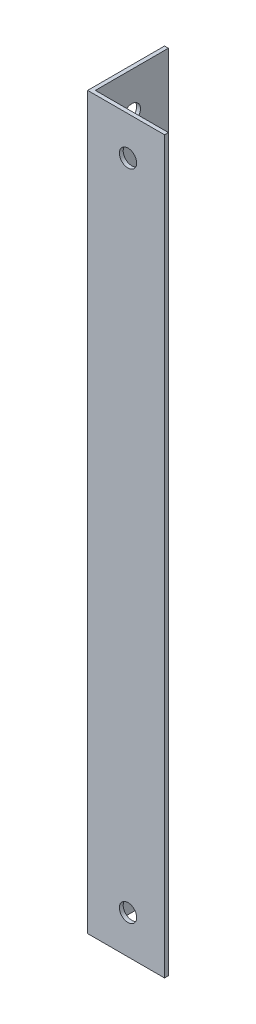
ISO-10303-21;
HEADER;
FILE_DESCRIPTION(('STEP AP214'),'2;1');
FILE_NAME('part.step','',(''),(''),'','','');
FILE_SCHEMA(('AUTOMOTIVE_DESIGN { 1 0 10303 214 1 1 1 1 }'));
ENDSEC;
DATA;
#1=APPLICATION_CONTEXT('core data for automotive mechanical design processes');
#2=APPLICATION_PROTOCOL_DEFINITION('international standard','automotive_design',2000,#1);
#3=PRODUCT_CONTEXT('',#1,'mechanical');
#4=PRODUCT('Part','Part','',(#3));
#5=PRODUCT_RELATED_PRODUCT_CATEGORY('part','',(#4));
#6=PRODUCT_DEFINITION_FORMATION('','',#4);
#7=PRODUCT_DEFINITION_CONTEXT('part definition',#1,'design');
#8=PRODUCT_DEFINITION('design','',#6,#7);
#9=PRODUCT_DEFINITION_SHAPE('','',#8);
#10=(LENGTH_UNIT() NAMED_UNIT(*) SI_UNIT(.MILLI.,.METRE.));
#11=(NAMED_UNIT(*) PLANE_ANGLE_UNIT() SI_UNIT($,.RADIAN.));
#12=(NAMED_UNIT(*) SI_UNIT($,.STERADIAN.) SOLID_ANGLE_UNIT());
#13=UNCERTAINTY_MEASURE_WITH_UNIT(LENGTH_MEASURE(1.E-05),#10,'distance_accuracy_value','');
#14=(GEOMETRIC_REPRESENTATION_CONTEXT(3) GLOBAL_UNCERTAINTY_ASSIGNED_CONTEXT((#13)) GLOBAL_UNIT_ASSIGNED_CONTEXT((#10,
#11,#12)) REPRESENTATION_CONTEXT('',''));
#15=CARTESIAN_POINT('',(0.,0.,0.));
#16=DIRECTION('',(0.,0.,1.));
#17=DIRECTION('',(1.,0.,0.));
#18=AXIS2_PLACEMENT_3D('',#15,#16,#17);
#19=CARTESIAN_POINT('',(20.,190.,0.));
#20=DIRECTION('',(0.,0.,-1.));
#21=DIRECTION('',(-1.,0.,0.));
#22=AXIS2_PLACEMENT_3D('',#19,#20,#21);
#23=PLANE('',#22);
#24=CARTESIAN_POINT('',(10.5,10.,0.));
#25=DIRECTION('',(0.,0.,-1.));
#26=DIRECTION('',(-1.,0.,0.));
#27=AXIS2_PLACEMENT_3D('',#24,#25,#26);
#28=CIRCLE('',#27,2.25);
#29=CARTESIAN_POINT('',(8.24999999999998,10.,0.));
#30=VERTEX_POINT('',#29);
#31=EDGE_CURVE('E178',#30,#30,#28,.T.);
#32=ORIENTED_EDGE('',*,*,#31,.T.);
#33=EDGE_LOOP('',(#32));
#34=FACE_BOUND('',#33,.T.);
#35=CARTESIAN_POINT('',(10.5,180.,0.));
#36=DIRECTION('',(0.,0.,-1.));
#37=DIRECTION('',(-1.,0.,0.));
#38=AXIS2_PLACEMENT_3D('',#35,#36,#37);
#39=CIRCLE('',#38,2.25);
#40=CARTESIAN_POINT('',(8.24999999999999,180.,0.));
#41=VERTEX_POINT('',#40);
#42=EDGE_CURVE('E181',#41,#41,#39,.T.);
#43=ORIENTED_EDGE('',*,*,#42,.T.);
#44=EDGE_LOOP('',(#43));
#45=FACE_BOUND('',#44,.T.);
#46=DIRECTION('',(1.,0.,0.));
#47=VECTOR('',#46,1.);
#48=CARTESIAN_POINT('',(20.,0.,0.));
#49=LINE('',#48,#47);
#50=CARTESIAN_POINT('',(0.,0.,0.));
#51=VERTEX_POINT('',#50);
#52=CARTESIAN_POINT('',(20.,0.,0.));
#53=VERTEX_POINT('',#52);
#54=EDGE_CURVE('E132',#51,#53,#49,.T.);
#55=ORIENTED_EDGE('',*,*,#54,.T.);
#56=DIRECTION('',(0.,-1.,0.));
#57=VECTOR('',#56,1.);
#58=CARTESIAN_POINT('',(20.,190.,0.));
#59=LINE('',#58,#57);
#60=CARTESIAN_POINT('',(20.,190.,0.));
#61=VERTEX_POINT('',#60);
#62=EDGE_CURVE('E13',#61,#53,#59,.T.);
#63=ORIENTED_EDGE('',*,*,#62,.F.);
#64=DIRECTION('',(1.,0.,0.));
#65=VECTOR('',#64,1.);
#66=CARTESIAN_POINT('',(20.,190.,0.));
#67=LINE('',#66,#65);
#68=CARTESIAN_POINT('',(0.,190.,0.));
#69=VERTEX_POINT('',#68);
#70=EDGE_CURVE('E143',#69,#61,#67,.T.);
#71=ORIENTED_EDGE('',*,*,#70,.F.);
#72=DIRECTION('',(0.,-1.,0.));
#73=VECTOR('',#72,1.);
#74=CARTESIAN_POINT('',(0.,190.,0.));
#75=LINE('',#74,#73);
#76=EDGE_CURVE('E128',#69,#51,#75,.T.);
#77=ORIENTED_EDGE('',*,*,#76,.T.);
#78=EDGE_LOOP('',(#55,#63,#71,#77));
#79=FACE_BOUND('',#78,.T.);
#80=ADVANCED_FACE('F48',(#34,#45,#79),#23,.F.);
#81=CARTESIAN_POINT('',(20.,190.,-0.999999999999998));
#82=DIRECTION('',(-1.,0.,0.));
#83=DIRECTION('',(0.,0.,1.));
#84=AXIS2_PLACEMENT_3D('',#81,#82,#83);
#85=PLANE('',#84);
#86=DIRECTION('',(0.,0.,-1.));
#87=VECTOR('',#86,1.);
#88=CARTESIAN_POINT('',(20.,0.,-0.999999999999998));
#89=LINE('',#88,#87);
#90=CARTESIAN_POINT('',(20.,0.,-0.999999999999998));
#91=VERTEX_POINT('',#90);
#92=EDGE_CURVE('E135',#53,#91,#89,.T.);
#93=ORIENTED_EDGE('',*,*,#92,.T.);
#94=DIRECTION('',(0.,-1.,0.));
#95=VECTOR('',#94,1.);
#96=CARTESIAN_POINT('',(20.,190.,-0.999999999999998));
#97=LINE('',#96,#95);
#98=CARTESIAN_POINT('',(20.,190.,-0.999999999999998));
#99=VERTEX_POINT('',#98);
#100=EDGE_CURVE('E56',#99,#91,#97,.T.);
#101=ORIENTED_EDGE('',*,*,#100,.F.);
#102=DIRECTION('',(0.,0.,-1.));
#103=VECTOR('',#102,1.);
#104=CARTESIAN_POINT('',(20.,190.,-0.999999999999998));
#105=LINE('',#104,#103);
#106=EDGE_CURVE('E101',#61,#99,#105,.T.);
#107=ORIENTED_EDGE('',*,*,#106,.F.);
#108=ORIENTED_EDGE('',*,*,#62,.T.);
#109=EDGE_LOOP('',(#93,#101,#107,#108));
#110=FACE_BOUND('',#109,.T.);
#111=ADVANCED_FACE('F170',(#110),#85,.F.);
#112=CARTESIAN_POINT('',(1.,190.,-0.999999999999998));
#113=DIRECTION('',(0.,0.,1.));
#114=DIRECTION('',(1.,0.,0.));
#115=AXIS2_PLACEMENT_3D('',#112,#113,#114);
#116=PLANE('',#115);
#117=CARTESIAN_POINT('',(10.5,10.,-0.999999999999998));
#118=DIRECTION('',(0.,0.,-1.));
#119=DIRECTION('',(-1.,0.,0.));
#120=AXIS2_PLACEMENT_3D('',#117,#118,#119);
#121=CIRCLE('',#120,2.25);
#122=CARTESIAN_POINT('',(8.24999999999998,10.,-0.999999999999998));
#123=VERTEX_POINT('',#122);
#124=EDGE_CURVE('E192',#123,#123,#121,.T.);
#125=ORIENTED_EDGE('',*,*,#124,.F.);
#126=EDGE_LOOP('',(#125));
#127=FACE_BOUND('',#126,.T.);
#128=CARTESIAN_POINT('',(10.5,180.,-0.999999999999998));
#129=DIRECTION('',(0.,0.,-1.));
#130=DIRECTION('',(-1.,0.,0.));
#131=AXIS2_PLACEMENT_3D('',#128,#129,#130);
#132=CIRCLE('',#131,2.25);
#133=CARTESIAN_POINT('',(8.24999999999999,180.,-0.999999999999998));
#134=VERTEX_POINT('',#133);
#135=EDGE_CURVE('E184',#134,#134,#132,.T.);
#136=ORIENTED_EDGE('',*,*,#135,.F.);
#137=EDGE_LOOP('',(#136));
#138=FACE_BOUND('',#137,.T.);
#139=DIRECTION('',(-1.,0.,0.));
#140=VECTOR('',#139,1.);
#141=CARTESIAN_POINT('',(1.,0.,-0.999999999999998));
#142=LINE('',#141,#140);
#143=CARTESIAN_POINT('',(1.,0.,-0.999999999999998));
#144=VERTEX_POINT('',#143);
#145=EDGE_CURVE('E138',#91,#144,#142,.T.);
#146=ORIENTED_EDGE('',*,*,#145,.T.);
#147=DIRECTION('',(0.,-1.,0.));
#148=VECTOR('',#147,1.);
#149=CARTESIAN_POINT('',(1.,190.,-0.999999999999998));
#150=LINE('',#149,#148);
#151=CARTESIAN_POINT('',(1.,190.,-0.999999999999998));
#152=VERTEX_POINT('',#151);
#153=EDGE_CURVE('E123',#152,#144,#150,.T.);
#154=ORIENTED_EDGE('',*,*,#153,.F.);
#155=DIRECTION('',(-1.,0.,0.));
#156=VECTOR('',#155,1.);
#157=CARTESIAN_POINT('',(1.,190.,-0.999999999999998));
#158=LINE('',#157,#156);
#159=EDGE_CURVE('E114',#99,#152,#158,.T.);
#160=ORIENTED_EDGE('',*,*,#159,.F.);
#161=ORIENTED_EDGE('',*,*,#100,.T.);
#162=EDGE_LOOP('',(#146,#154,#160,#161));
#163=FACE_BOUND('',#162,.T.);
#164=ADVANCED_FACE('F149',(#127,#138,#163),#116,.F.);
#165=CARTESIAN_POINT('',(1.,190.,-20.));
#166=DIRECTION('',(-1.,0.,0.));
#167=DIRECTION('',(0.,0.,1.));
#168=AXIS2_PLACEMENT_3D('',#165,#166,#167);
#169=PLANE('',#168);
#170=CARTESIAN_POINT('',(1.,180.,-10.5));
#171=DIRECTION('',(1.,0.,0.));
#172=DIRECTION('',(0.,0.,-1.));
#173=AXIS2_PLACEMENT_3D('',#170,#171,#172);
#174=CIRCLE('',#173,2.25);
#175=CARTESIAN_POINT('',(1.,180.,-12.75));
#176=VERTEX_POINT('',#175);
#177=EDGE_CURVE('E183',#176,#176,#174,.T.);
#178=ORIENTED_EDGE('',*,*,#177,.F.);
#179=EDGE_LOOP('',(#178));
#180=FACE_BOUND('',#179,.T.);
#181=CARTESIAN_POINT('',(1.,10.,-10.5));
#182=DIRECTION('',(1.,0.,0.));
#183=DIRECTION('',(0.,0.,-1.));
#184=AXIS2_PLACEMENT_3D('',#181,#182,#183);
#185=CIRCLE('',#184,2.25);
#186=CARTESIAN_POINT('',(1.,10.,-12.75));
#187=VERTEX_POINT('',#186);
#188=EDGE_CURVE('E195',#187,#187,#185,.T.);
#189=ORIENTED_EDGE('',*,*,#188,.F.);
#190=EDGE_LOOP('',(#189));
#191=FACE_BOUND('',#190,.T.);
#192=DIRECTION('',(0.,0.,-1.));
#193=VECTOR('',#192,1.);
#194=CARTESIAN_POINT('',(1.,0.,-20.));
#195=LINE('',#194,#193);
#196=CARTESIAN_POINT('',(1.,0.,-20.));
#197=VERTEX_POINT('',#196);
#198=EDGE_CURVE('E122',#144,#197,#195,.T.);
#199=ORIENTED_EDGE('',*,*,#198,.T.);
#200=DIRECTION('',(0.,-1.,0.));
#201=VECTOR('',#200,1.);
#202=CARTESIAN_POINT('',(1.,190.,-20.));
#203=LINE('',#202,#201);
#204=CARTESIAN_POINT('',(1.,190.,-20.));
#205=VERTEX_POINT('',#204);
#206=EDGE_CURVE('E119',#205,#197,#203,.T.);
#207=ORIENTED_EDGE('',*,*,#206,.F.);
#208=DIRECTION('',(0.,0.,-1.));
#209=VECTOR('',#208,1.);
#210=CARTESIAN_POINT('',(1.,190.,-20.));
#211=LINE('',#210,#209);
#212=EDGE_CURVE('E108',#152,#205,#211,.T.);
#213=ORIENTED_EDGE('',*,*,#212,.F.);
#214=ORIENTED_EDGE('',*,*,#153,.T.);
#215=EDGE_LOOP('',(#199,#207,#213,#214));
#216=FACE_BOUND('',#215,.T.);
#217=ADVANCED_FACE('F120',(#180,#191,#216),#169,.F.);
#218=CARTESIAN_POINT('',(0.,190.,-20.));
#219=DIRECTION('',(0.,0.,1.));
#220=DIRECTION('',(1.,0.,0.));
#221=AXIS2_PLACEMENT_3D('',#218,#219,#220);
#222=PLANE('',#221);
#223=DIRECTION('',(-1.,0.,0.));
#224=VECTOR('',#223,1.);
#225=CARTESIAN_POINT('',(0.,0.,-20.));
#226=LINE('',#225,#224);
#227=CARTESIAN_POINT('',(0.,0.,-20.));
#228=VERTEX_POINT('',#227);
#229=EDGE_CURVE('E87',#197,#228,#226,.T.);
#230=ORIENTED_EDGE('',*,*,#229,.T.);
#231=DIRECTION('',(0.,-1.,0.));
#232=VECTOR('',#231,1.);
#233=CARTESIAN_POINT('',(0.,190.,-20.));
#234=LINE('',#233,#232);
#235=CARTESIAN_POINT('',(0.,190.,-20.));
#236=VERTEX_POINT('',#235);
#237=EDGE_CURVE('E124',#236,#228,#234,.T.);
#238=ORIENTED_EDGE('',*,*,#237,.F.);
#239=DIRECTION('',(-1.,0.,0.));
#240=VECTOR('',#239,1.);
#241=CARTESIAN_POINT('',(0.,190.,-20.));
#242=LINE('',#241,#240);
#243=EDGE_CURVE('E112',#205,#236,#242,.T.);
#244=ORIENTED_EDGE('',*,*,#243,.F.);
#245=ORIENTED_EDGE('',*,*,#206,.T.);
#246=EDGE_LOOP('',(#230,#238,#244,#245));
#247=FACE_BOUND('',#246,.T.);
#248=ADVANCED_FACE('F126',(#247),#222,.F.);
#249=CARTESIAN_POINT('',(0.,190.,0.));
#250=DIRECTION('',(1.,0.,0.));
#251=DIRECTION('',(0.,0.,-1.));
#252=AXIS2_PLACEMENT_3D('',#249,#250,#251);
#253=PLANE('',#252);
#254=CARTESIAN_POINT('',(0.,180.,-10.5));
#255=DIRECTION('',(1.,0.,0.));
#256=DIRECTION('',(0.,0.,-1.));
#257=AXIS2_PLACEMENT_3D('',#254,#255,#256);
#258=CIRCLE('',#257,2.25);
#259=CARTESIAN_POINT('',(0.,180.,-12.75));
#260=VERTEX_POINT('',#259);
#261=EDGE_CURVE('E187',#260,#260,#258,.T.);
#262=ORIENTED_EDGE('',*,*,#261,.T.);
#263=EDGE_LOOP('',(#262));
#264=FACE_BOUND('',#263,.T.);
#265=CARTESIAN_POINT('',(0.,10.,-10.5));
#266=DIRECTION('',(1.,0.,0.));
#267=DIRECTION('',(0.,0.,-1.));
#268=AXIS2_PLACEMENT_3D('',#265,#266,#267);
#269=CIRCLE('',#268,2.25);
#270=CARTESIAN_POINT('',(0.,10.,-12.75));
#271=VERTEX_POINT('',#270);
#272=EDGE_CURVE('E136',#271,#271,#269,.T.);
#273=ORIENTED_EDGE('',*,*,#272,.T.);
#274=EDGE_LOOP('',(#273));
#275=FACE_BOUND('',#274,.T.);
#276=DIRECTION('',(0.,0.,1.));
#277=VECTOR('',#276,1.);
#278=CARTESIAN_POINT('',(0.,0.,0.));
#279=LINE('',#278,#277);
#280=EDGE_CURVE('E93',#228,#51,#279,.T.);
#281=ORIENTED_EDGE('',*,*,#280,.T.);
#282=ORIENTED_EDGE('',*,*,#76,.F.);
#283=DIRECTION('',(0.,0.,1.));
#284=VECTOR('',#283,1.);
#285=CARTESIAN_POINT('',(0.,190.,0.));
#286=LINE('',#285,#284);
#287=EDGE_CURVE('E64',#236,#69,#286,.T.);
#288=ORIENTED_EDGE('',*,*,#287,.F.);
#289=ORIENTED_EDGE('',*,*,#237,.T.);
#290=EDGE_LOOP('',(#281,#282,#288,#289));
#291=FACE_BOUND('',#290,.T.);
#292=ADVANCED_FACE('F156',(#264,#275,#291),#253,.F.);
#293=CARTESIAN_POINT('',(0.,190.,0.));
#294=DIRECTION('',(0.,-1.,0.));
#295=DIRECTION('',(0.,0.,-1.));
#296=AXIS2_PLACEMENT_3D('',#293,#294,#295);
#297=PLANE('',#296);
#298=ORIENTED_EDGE('',*,*,#70,.T.);
#299=ORIENTED_EDGE('',*,*,#106,.T.);
#300=ORIENTED_EDGE('',*,*,#159,.T.);
#301=ORIENTED_EDGE('',*,*,#212,.T.);
#302=ORIENTED_EDGE('',*,*,#243,.T.);
#303=ORIENTED_EDGE('',*,*,#287,.T.);
#304=EDGE_LOOP('',(#298,#299,#300,#301,#302,#303));
#305=FACE_BOUND('',#304,.T.);
#306=ADVANCED_FACE('F110',(#305),#297,.F.);
#307=CARTESIAN_POINT('',(0.,0.,0.));
#308=DIRECTION('',(0.,-1.,0.));
#309=DIRECTION('',(0.,0.,-1.));
#310=AXIS2_PLACEMENT_3D('',#307,#308,#309);
#311=PLANE('',#310);
#312=ORIENTED_EDGE('',*,*,#54,.F.);
#313=ORIENTED_EDGE('',*,*,#280,.F.);
#314=ORIENTED_EDGE('',*,*,#229,.F.);
#315=ORIENTED_EDGE('',*,*,#198,.F.);
#316=ORIENTED_EDGE('',*,*,#145,.F.);
#317=ORIENTED_EDGE('',*,*,#92,.F.);
#318=EDGE_LOOP('',(#312,#313,#314,#315,#316,#317));
#319=FACE_BOUND('',#318,.T.);
#320=ADVANCED_FACE('F152',(#319),#311,.T.);
#321=CARTESIAN_POINT('',(0.,10.,-10.5));
#322=DIRECTION('',(1.,0.,0.));
#323=DIRECTION('',(0.,0.,-1.));
#324=AXIS2_PLACEMENT_3D('',#321,#322,#323);
#325=CYLINDRICAL_SURFACE('',#324,2.25);
#326=ORIENTED_EDGE('',*,*,#272,.F.);
#327=EDGE_LOOP('',(#326));
#328=FACE_BOUND('',#327,.T.);
#329=ORIENTED_EDGE('',*,*,#188,.T.);
#330=EDGE_LOOP('',(#329));
#331=FACE_BOUND('',#330,.T.);
#332=ADVANCED_FACE('F204',(#328,#331),#325,.F.);
#333=CARTESIAN_POINT('',(0.,180.,-10.5));
#334=DIRECTION('',(1.,0.,0.));
#335=DIRECTION('',(0.,0.,-1.));
#336=AXIS2_PLACEMENT_3D('',#333,#334,#335);
#337=CYLINDRICAL_SURFACE('',#336,2.25);
#338=ORIENTED_EDGE('',*,*,#261,.F.);
#339=EDGE_LOOP('',(#338));
#340=FACE_BOUND('',#339,.T.);
#341=ORIENTED_EDGE('',*,*,#177,.T.);
#342=EDGE_LOOP('',(#341));
#343=FACE_BOUND('',#342,.T.);
#344=ADVANCED_FACE('F216',(#340,#343),#337,.F.);
#345=CARTESIAN_POINT('',(10.5,180.,0.));
#346=DIRECTION('',(0.,0.,-1.));
#347=DIRECTION('',(-1.,0.,0.));
#348=AXIS2_PLACEMENT_3D('',#345,#346,#347);
#349=CYLINDRICAL_SURFACE('',#348,2.25);
#350=ORIENTED_EDGE('',*,*,#42,.F.);
#351=EDGE_LOOP('',(#350));
#352=FACE_BOUND('',#351,.T.);
#353=ORIENTED_EDGE('',*,*,#135,.T.);
#354=EDGE_LOOP('',(#353));
#355=FACE_BOUND('',#354,.T.);
#356=ADVANCED_FACE('F218',(#352,#355),#349,.F.);
#357=CARTESIAN_POINT('',(10.5,10.,0.));
#358=DIRECTION('',(0.,0.,-1.));
#359=DIRECTION('',(-1.,0.,0.));
#360=AXIS2_PLACEMENT_3D('',#357,#358,#359);
#361=CYLINDRICAL_SURFACE('',#360,2.25);
#362=ORIENTED_EDGE('',*,*,#31,.F.);
#363=EDGE_LOOP('',(#362));
#364=FACE_BOUND('',#363,.T.);
#365=ORIENTED_EDGE('',*,*,#124,.T.);
#366=EDGE_LOOP('',(#365));
#367=FACE_BOUND('',#366,.T.);
#368=ADVANCED_FACE('F225',(#364,#367),#361,.F.);
#369=CLOSED_SHELL('',(#80,#111,#164,#217,#248,#292,#306,#320,#332,#344,#356,#368));
#370=MANIFOLD_SOLID_BREP('B2',#369);
#371=ADVANCED_BREP_SHAPE_REPRESENTATION('',(#18,#370),#14);
#372=SHAPE_DEFINITION_REPRESENTATION(#9,#371);
ENDSEC;
END-ISO-10303-21;
